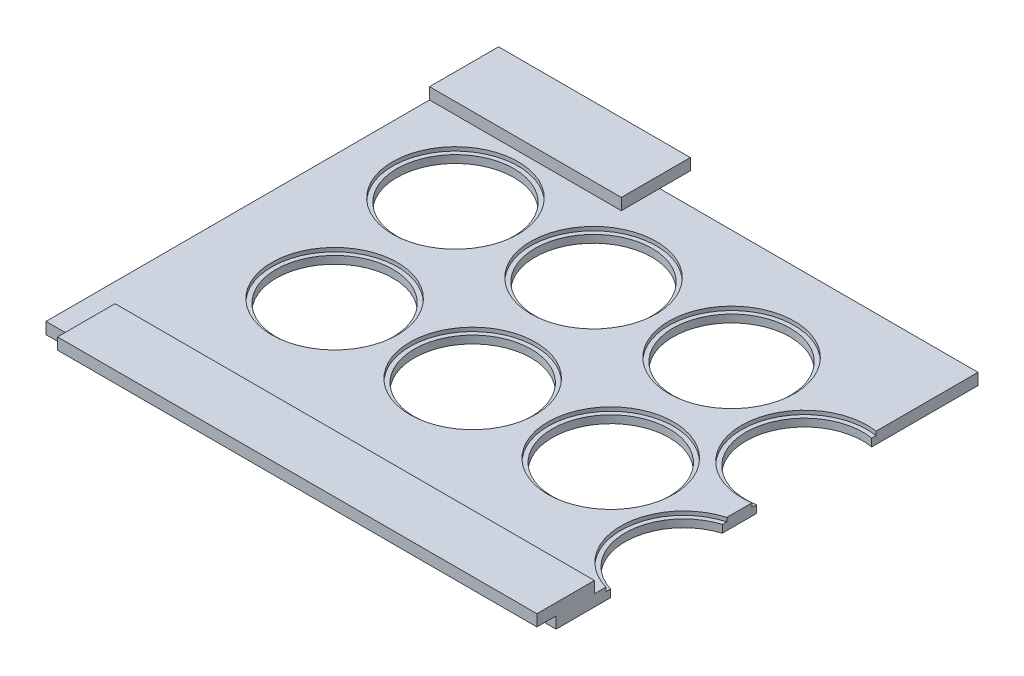
ISO-10303-21;
HEADER;
FILE_DESCRIPTION(('STEP AP214'),'2;1');
FILE_NAME('part.step','',(''),(''),'','','');
FILE_SCHEMA(('AUTOMOTIVE_DESIGN { 1 0 10303 214 1 1 1 1 }'));
ENDSEC;
DATA;
#1=APPLICATION_CONTEXT('core data for automotive mechanical design processes');
#2=APPLICATION_PROTOCOL_DEFINITION('international standard','automotive_design',2000,#1);
#3=PRODUCT_CONTEXT('',#1,'mechanical');
#4=PRODUCT('Part','Part','',(#3));
#5=PRODUCT_RELATED_PRODUCT_CATEGORY('part','',(#4));
#6=PRODUCT_DEFINITION_FORMATION('','',#4);
#7=PRODUCT_DEFINITION_CONTEXT('part definition',#1,'design');
#8=PRODUCT_DEFINITION('design','',#6,#7);
#9=PRODUCT_DEFINITION_SHAPE('','',#8);
#10=(LENGTH_UNIT() NAMED_UNIT(*) SI_UNIT(.MILLI.,.METRE.));
#11=(NAMED_UNIT(*) PLANE_ANGLE_UNIT() SI_UNIT($,.RADIAN.));
#12=(NAMED_UNIT(*) SI_UNIT($,.STERADIAN.) SOLID_ANGLE_UNIT());
#13=UNCERTAINTY_MEASURE_WITH_UNIT(LENGTH_MEASURE(1.E-05),#10,'distance_accuracy_value','');
#14=(GEOMETRIC_REPRESENTATION_CONTEXT(3) GLOBAL_UNCERTAINTY_ASSIGNED_CONTEXT((#13)) GLOBAL_UNIT_ASSIGNED_CONTEXT((#10,
#11,#12)) REPRESENTATION_CONTEXT('',''));
#15=CARTESIAN_POINT('',(0.,0.,0.));
#16=DIRECTION('',(0.,0.,1.));
#17=DIRECTION('',(1.,0.,0.));
#18=AXIS2_PLACEMENT_3D('',#15,#16,#17);
#19=CARTESIAN_POINT('',(25.5,46.1335136523794,-81.25));
#20=DIRECTION('',(0.,-1.,0.));
#21=DIRECTION('',(0.,0.,-1.));
#22=AXIS2_PLACEMENT_3D('',#19,#20,#21);
#23=CYLINDRICAL_SURFACE('',#22,15.25);
#24=CARTESIAN_POINT('',(25.5,0.,-81.25));
#25=DIRECTION('',(0.,-1.,0.));
#26=DIRECTION('',(0.,0.,-1.));
#27=AXIS2_PLACEMENT_3D('',#24,#25,#26);
#28=CIRCLE('',#27,15.25);
#29=CARTESIAN_POINT('',(25.5,0.,-96.5));
#30=VERTEX_POINT('',#29);
#31=EDGE_CURVE('E288',#30,#30,#28,.T.);
#32=ORIENTED_EDGE('',*,*,#31,.T.);
#33=EDGE_LOOP('',(#32));
#34=FACE_BOUND('',#33,.T.);
#35=CARTESIAN_POINT('',(25.5,2.,-81.25));
#36=DIRECTION('',(0.,1.,0.));
#37=DIRECTION('',(0.,0.,1.));
#38=AXIS2_PLACEMENT_3D('',#35,#36,#37);
#39=CIRCLE('',#38,15.25);
#40=CARTESIAN_POINT('',(25.5,2.,-66.));
#41=VERTEX_POINT('',#40);
#42=EDGE_CURVE('E262',#41,#41,#39,.F.);
#43=ORIENTED_EDGE('',*,*,#42,.F.);
#44=EDGE_LOOP('',(#43));
#45=FACE_BOUND('',#44,.T.);
#46=ADVANCED_FACE('F34',(#34,#45),#23,.F.);
#47=CARTESIAN_POINT('',(137.5,46.1335136523794,-28.75));
#48=DIRECTION('',(0.,-1.,0.));
#49=DIRECTION('',(0.,0.,-1.));
#50=AXIS2_PLACEMENT_3D('',#47,#48,#49);
#51=CYLINDRICAL_SURFACE('',#50,15.25);
#52=CARTESIAN_POINT('',(137.5,2.,-28.75));
#53=DIRECTION('',(0.,1.,0.));
#54=DIRECTION('',(0.,0.,1.));
#55=AXIS2_PLACEMENT_3D('',#52,#53,#54);
#56=CIRCLE('',#55,15.25);
#57=CARTESIAN_POINT('',(133.,2.,-14.1790528791022));
#58=VERTEX_POINT('',#57);
#59=CARTESIAN_POINT('',(133.,2.,-43.3209471208978));
#60=VERTEX_POINT('',#59);
#61=EDGE_CURVE('E42',#58,#60,#56,.F.);
#62=ORIENTED_EDGE('',*,*,#61,.F.);
#63=DIRECTION('',(0.,-1.,0.));
#64=VECTOR('',#63,1.);
#65=CARTESIAN_POINT('',(133.,46.1335136523794,-14.1790528791022));
#66=LINE('',#65,#64);
#67=CARTESIAN_POINT('',(133.,0.,-14.1790528791022));
#68=VERTEX_POINT('',#67);
#69=EDGE_CURVE('E296',#68,#58,#66,.F.);
#70=ORIENTED_EDGE('',*,*,#69,.F.);
#71=CARTESIAN_POINT('',(137.5,0.,-28.75));
#72=DIRECTION('',(0.,-1.,0.));
#73=DIRECTION('',(0.,0.,-1.));
#74=AXIS2_PLACEMENT_3D('',#71,#72,#73);
#75=CIRCLE('',#74,15.25);
#76=CARTESIAN_POINT('',(133.,0.,-43.3209471208978));
#77=VERTEX_POINT('',#76);
#78=EDGE_CURVE('E275',#68,#77,#75,.T.);
#79=ORIENTED_EDGE('',*,*,#78,.T.);
#80=DIRECTION('',(0.,-1.,0.));
#81=VECTOR('',#80,1.);
#82=CARTESIAN_POINT('',(133.,46.1335136523794,-43.3209471208978));
#83=LINE('',#82,#81);
#84=EDGE_CURVE('E299',#60,#77,#83,.T.);
#85=ORIENTED_EDGE('',*,*,#84,.F.);
#86=EDGE_LOOP('',(#62,#70,#79,#85));
#87=FACE_BOUND('',#86,.T.);
#88=ADVANCED_FACE('F472',(#87),#51,.F.);
#89=CARTESIAN_POINT('',(104.5,46.1335136523794,-42.75));
#90=DIRECTION('',(0.,-1.,0.));
#91=DIRECTION('',(0.,0.,-1.));
#92=AXIS2_PLACEMENT_3D('',#89,#90,#91);
#93=CYLINDRICAL_SURFACE('',#92,15.25);
#94=CARTESIAN_POINT('',(104.5,0.,-42.75));
#95=DIRECTION('',(0.,-1.,0.));
#96=DIRECTION('',(0.,0.,-1.));
#97=AXIS2_PLACEMENT_3D('',#94,#95,#96);
#98=CIRCLE('',#97,15.25);
#99=CARTESIAN_POINT('',(104.5,0.,-58.));
#100=VERTEX_POINT('',#99);
#101=EDGE_CURVE('E280',#100,#100,#98,.T.);
#102=ORIENTED_EDGE('',*,*,#101,.T.);
#103=EDGE_LOOP('',(#102));
#104=FACE_BOUND('',#103,.T.);
#105=CARTESIAN_POINT('',(104.5,2.,-42.75));
#106=DIRECTION('',(0.,1.,0.));
#107=DIRECTION('',(0.,0.,1.));
#108=AXIS2_PLACEMENT_3D('',#105,#106,#107);
#109=CIRCLE('',#108,15.25);
#110=CARTESIAN_POINT('',(104.5,2.,-27.5));
#111=VERTEX_POINT('',#110);
#112=EDGE_CURVE('E258',#111,#111,#109,.F.);
#113=ORIENTED_EDGE('',*,*,#112,.F.);
#114=EDGE_LOOP('',(#113));
#115=FACE_BOUND('',#114,.T.);
#116=ADVANCED_FACE('F499',(#104,#115),#93,.F.);
#117=CARTESIAN_POINT('',(68.5,46.1335136523794,-42.75));
#118=DIRECTION('',(0.,-1.,0.));
#119=DIRECTION('',(0.,0.,-1.));
#120=AXIS2_PLACEMENT_3D('',#117,#118,#119);
#121=CYLINDRICAL_SURFACE('',#120,15.25);
#122=CARTESIAN_POINT('',(68.5,0.,-42.75));
#123=DIRECTION('',(0.,-1.,0.));
#124=DIRECTION('',(0.,0.,-1.));
#125=AXIS2_PLACEMENT_3D('',#122,#123,#124);
#126=CIRCLE('',#125,15.25);
#127=CARTESIAN_POINT('',(68.5,0.,-58.));
#128=VERTEX_POINT('',#127);
#129=EDGE_CURVE('E276',#128,#128,#126,.T.);
#130=ORIENTED_EDGE('',*,*,#129,.T.);
#131=EDGE_LOOP('',(#130));
#132=FACE_BOUND('',#131,.T.);
#133=CARTESIAN_POINT('',(68.5,2.,-42.75));
#134=DIRECTION('',(0.,1.,0.));
#135=DIRECTION('',(0.,0.,1.));
#136=AXIS2_PLACEMENT_3D('',#133,#134,#135);
#137=CIRCLE('',#136,15.25);
#138=CARTESIAN_POINT('',(68.5,2.,-27.5));
#139=VERTEX_POINT('',#138);
#140=EDGE_CURVE('E255',#139,#139,#137,.F.);
#141=ORIENTED_EDGE('',*,*,#140,.F.);
#142=EDGE_LOOP('',(#141));
#143=FACE_BOUND('',#142,.T.);
#144=ADVANCED_FACE('F567',(#132,#143),#121,.F.);
#145=CARTESIAN_POINT('',(130.5,46.1335136523794,-67.25));
#146=DIRECTION('',(0.,-1.,0.));
#147=DIRECTION('',(0.,0.,-1.));
#148=AXIS2_PLACEMENT_3D('',#145,#146,#147);
#149=CYLINDRICAL_SURFACE('',#148,15.25);
#150=CARTESIAN_POINT('',(130.5,2.,-67.25));
#151=DIRECTION('',(0.,1.,0.));
#152=DIRECTION('',(0.,0.,1.));
#153=AXIS2_PLACEMENT_3D('',#150,#151,#152);
#154=CIRCLE('',#153,15.25);
#155=CARTESIAN_POINT('',(133.,2.,-52.2063136166696));
#156=VERTEX_POINT('',#155);
#157=CARTESIAN_POINT('',(133.,2.,-82.2936863833304));
#158=VERTEX_POINT('',#157);
#159=EDGE_CURVE('E243',#156,#158,#154,.F.);
#160=ORIENTED_EDGE('',*,*,#159,.F.);
#161=DIRECTION('',(0.,-1.,0.));
#162=VECTOR('',#161,1.);
#163=CARTESIAN_POINT('',(133.,46.1335136523794,-52.2063136166696));
#164=LINE('',#163,#162);
#165=CARTESIAN_POINT('',(133.,0.,-52.2063136166696));
#166=VERTEX_POINT('',#165);
#167=EDGE_CURVE('E301',#166,#156,#164,.F.);
#168=ORIENTED_EDGE('',*,*,#167,.F.);
#169=CARTESIAN_POINT('',(130.5,0.,-67.25));
#170=DIRECTION('',(0.,-1.,0.));
#171=DIRECTION('',(0.,0.,-1.));
#172=AXIS2_PLACEMENT_3D('',#169,#170,#171);
#173=CIRCLE('',#172,15.25);
#174=CARTESIAN_POINT('',(133.,0.,-82.2936863833304));
#175=VERTEX_POINT('',#174);
#176=EDGE_CURVE('E240',#166,#175,#173,.T.);
#177=ORIENTED_EDGE('',*,*,#176,.T.);
#178=DIRECTION('',(0.,-1.,0.));
#179=VECTOR('',#178,1.);
#180=CARTESIAN_POINT('',(133.,46.1335136523794,-82.2936863833304));
#181=LINE('',#180,#179);
#182=EDGE_CURVE('E303',#158,#175,#181,.T.);
#183=ORIENTED_EDGE('',*,*,#182,.F.);
#184=EDGE_LOOP('',(#160,#168,#177,#183));
#185=FACE_BOUND('',#184,.T.);
#186=ADVANCED_FACE('F504',(#185),#149,.F.);
#187=CARTESIAN_POINT('',(97.5,46.1335136523794,-81.25));
#188=DIRECTION('',(0.,-1.,0.));
#189=DIRECTION('',(0.,0.,-1.));
#190=AXIS2_PLACEMENT_3D('',#187,#188,#189);
#191=CYLINDRICAL_SURFACE('',#190,15.25);
#192=CARTESIAN_POINT('',(97.5,0.,-81.25));
#193=DIRECTION('',(0.,-1.,0.));
#194=DIRECTION('',(0.,0.,-1.));
#195=AXIS2_PLACEMENT_3D('',#192,#193,#194);
#196=CIRCLE('',#195,15.25);
#197=CARTESIAN_POINT('',(97.5,0.,-96.5));
#198=VERTEX_POINT('',#197);
#199=EDGE_CURVE('E279',#198,#198,#196,.T.);
#200=ORIENTED_EDGE('',*,*,#199,.T.);
#201=EDGE_LOOP('',(#200));
#202=FACE_BOUND('',#201,.T.);
#203=CARTESIAN_POINT('',(97.5,2.,-81.25));
#204=DIRECTION('',(0.,1.,0.));
#205=DIRECTION('',(0.,0.,1.));
#206=AXIS2_PLACEMENT_3D('',#203,#204,#205);
#207=CIRCLE('',#206,15.25);
#208=CARTESIAN_POINT('',(97.5,2.,-66.));
#209=VERTEX_POINT('',#208);
#210=EDGE_CURVE('E251',#209,#209,#207,.F.);
#211=ORIENTED_EDGE('',*,*,#210,.F.);
#212=EDGE_LOOP('',(#211));
#213=FACE_BOUND('',#212,.T.);
#214=ADVANCED_FACE('F551',(#202,#213),#191,.F.);
#215=CARTESIAN_POINT('',(61.5,46.1335136523794,-81.25));
#216=DIRECTION('',(0.,-1.,0.));
#217=DIRECTION('',(0.,0.,-1.));
#218=AXIS2_PLACEMENT_3D('',#215,#216,#217);
#219=CYLINDRICAL_SURFACE('',#218,15.25);
#220=CARTESIAN_POINT('',(61.5,0.,-81.25));
#221=DIRECTION('',(0.,-1.,0.));
#222=DIRECTION('',(0.,0.,-1.));
#223=AXIS2_PLACEMENT_3D('',#220,#221,#222);
#224=CIRCLE('',#223,15.25);
#225=CARTESIAN_POINT('',(61.5,0.,-96.5));
#226=VERTEX_POINT('',#225);
#227=EDGE_CURVE('E289',#226,#226,#224,.T.);
#228=ORIENTED_EDGE('',*,*,#227,.T.);
#229=EDGE_LOOP('',(#228));
#230=FACE_BOUND('',#229,.T.);
#231=CARTESIAN_POINT('',(61.5,2.,-81.25));
#232=DIRECTION('',(0.,1.,0.));
#233=DIRECTION('',(0.,0.,1.));
#234=AXIS2_PLACEMENT_3D('',#231,#232,#233);
#235=CIRCLE('',#234,15.25);
#236=CARTESIAN_POINT('',(61.5,2.,-66.));
#237=VERTEX_POINT('',#236);
#238=EDGE_CURVE('E247',#237,#237,#235,.F.);
#239=ORIENTED_EDGE('',*,*,#238,.F.);
#240=EDGE_LOOP('',(#239));
#241=FACE_BOUND('',#240,.T.);
#242=ADVANCED_FACE('F541',(#230,#241),#219,.F.);
#243=CARTESIAN_POINT('',(32.5,46.1335136523794,-42.75));
#244=DIRECTION('',(0.,-1.,0.));
#245=DIRECTION('',(0.,0.,-1.));
#246=AXIS2_PLACEMENT_3D('',#243,#244,#245);
#247=CYLINDRICAL_SURFACE('',#246,15.25);
#248=CARTESIAN_POINT('',(32.5,0.,-42.75));
#249=DIRECTION('',(0.,-1.,0.));
#250=DIRECTION('',(0.,0.,-1.));
#251=AXIS2_PLACEMENT_3D('',#248,#249,#250);
#252=CIRCLE('',#251,15.25);
#253=CARTESIAN_POINT('',(32.5,0.,-58.));
#254=VERTEX_POINT('',#253);
#255=EDGE_CURVE('E285',#254,#254,#252,.T.);
#256=ORIENTED_EDGE('',*,*,#255,.T.);
#257=EDGE_LOOP('',(#256));
#258=FACE_BOUND('',#257,.T.);
#259=CARTESIAN_POINT('',(32.5,2.,-42.75));
#260=DIRECTION('',(0.,1.,0.));
#261=DIRECTION('',(0.,0.,1.));
#262=AXIS2_PLACEMENT_3D('',#259,#260,#261);
#263=CIRCLE('',#262,15.25);
#264=CARTESIAN_POINT('',(32.5,2.,-27.5));
#265=VERTEX_POINT('',#264);
#266=EDGE_CURVE('E244',#265,#265,#263,.F.);
#267=ORIENTED_EDGE('',*,*,#266,.F.);
#268=EDGE_LOOP('',(#267));
#269=FACE_BOUND('',#268,.T.);
#270=ADVANCED_FACE('F536',(#258,#269),#247,.F.);
#271=CARTESIAN_POINT('',(133.,3.,0.));
#272=DIRECTION('',(-1.,0.,0.));
#273=DIRECTION('',(0.,0.,1.));
#274=AXIS2_PLACEMENT_3D('',#271,#272,#273);
#275=PLANE('',#274);
#276=DIRECTION('',(0.,0.,-1.));
#277=VECTOR('',#276,1.);
#278=CARTESIAN_POINT('',(133.,3.,0.));
#279=LINE('',#278,#277);
#280=CARTESIAN_POINT('',(133.,3.,-83.4330350985222));
#281=VERTEX_POINT('',#280);
#282=CARTESIAN_POINT('',(133.,3.,-110.));
#283=VERTEX_POINT('',#282);
#284=EDGE_CURVE('E204',#281,#283,#279,.T.);
#285=ORIENTED_EDGE('',*,*,#284,.F.);
#286=DIRECTION('',(0.,1.,0.));
#287=VECTOR('',#286,1.);
#288=CARTESIAN_POINT('',(133.,2.,-83.4330350985222));
#289=LINE('',#288,#287);
#290=CARTESIAN_POINT('',(133.,2.,-83.4330350985222));
#291=VERTEX_POINT('',#290);
#292=EDGE_CURVE('E184',#281,#291,#289,.F.);
#293=ORIENTED_EDGE('',*,*,#292,.T.);
#294=DIRECTION('',(0.,0.,-1.));
#295=VECTOR('',#294,1.);
#296=CARTESIAN_POINT('',(133.,2.,0.));
#297=LINE('',#296,#295);
#298=EDGE_CURVE('E259',#158,#291,#297,.T.);
#299=ORIENTED_EDGE('',*,*,#298,.F.);
#300=ORIENTED_EDGE('',*,*,#182,.T.);
#301=DIRECTION('',(0.,0.,-1.));
#302=VECTOR('',#301,1.);
#303=CARTESIAN_POINT('',(133.,0.,0.));
#304=LINE('',#303,#302);
#305=CARTESIAN_POINT('',(133.,0.,-110.));
#306=VERTEX_POINT('',#305);
#307=EDGE_CURVE('E221',#175,#306,#304,.T.);
#308=ORIENTED_EDGE('',*,*,#307,.T.);
#309=DIRECTION('',(0.,-1.,0.));
#310=VECTOR('',#309,1.);
#311=CARTESIAN_POINT('',(133.,3.,-110.));
#312=LINE('',#311,#310);
#313=EDGE_CURVE('E231',#283,#306,#312,.T.);
#314=ORIENTED_EDGE('',*,*,#313,.F.);
#315=EDGE_LOOP('',(#285,#293,#299,#300,#308,#314));
#316=FACE_BOUND('',#315,.T.);
#317=ADVANCED_FACE('F440',(#316),#275,.F.);
#318=CARTESIAN_POINT('',(133.,3.,-44.4945427053313));
#319=VERTEX_POINT('',#318);
#320=CARTESIAN_POINT('',(133.,3.,-51.0669649014778));
#321=VERTEX_POINT('',#320);
#322=EDGE_CURVE('E195',#319,#321,#279,.T.);
#323=ORIENTED_EDGE('',*,*,#322,.F.);
#324=DIRECTION('',(0.,1.,0.));
#325=VECTOR('',#324,1.);
#326=CARTESIAN_POINT('',(133.,2.,-44.4945427053313));
#327=LINE('',#326,#325);
#328=CARTESIAN_POINT('',(133.,2.,-44.4945427053313));
#329=VERTEX_POINT('',#328);
#330=EDGE_CURVE('E197',#319,#329,#327,.F.);
#331=ORIENTED_EDGE('',*,*,#330,.T.);
#332=DIRECTION('',(0.,0.,-1.));
#333=VECTOR('',#332,1.);
#334=CARTESIAN_POINT('',(133.,2.,0.));
#335=LINE('',#334,#333);
#336=EDGE_CURVE('E264',#60,#329,#335,.T.);
#337=ORIENTED_EDGE('',*,*,#336,.F.);
#338=ORIENTED_EDGE('',*,*,#84,.T.);
#339=EDGE_CURVE('E226',#77,#166,#304,.T.);
#340=ORIENTED_EDGE('',*,*,#339,.T.);
#341=ORIENTED_EDGE('',*,*,#167,.T.);
#342=DIRECTION('',(0.,0.,-1.));
#343=VECTOR('',#342,1.);
#344=CARTESIAN_POINT('',(133.,2.,0.));
#345=LINE('',#344,#343);
#346=CARTESIAN_POINT('',(133.,2.,-51.0669649014778));
#347=VERTEX_POINT('',#346);
#348=EDGE_CURVE('E57',#347,#156,#345,.T.);
#349=ORIENTED_EDGE('',*,*,#348,.F.);
#350=DIRECTION('',(0.,1.,0.));
#351=VECTOR('',#350,1.);
#352=CARTESIAN_POINT('',(133.,2.,-51.0669649014778));
#353=LINE('',#352,#351);
#354=EDGE_CURVE('E182',#347,#321,#353,.T.);
#355=ORIENTED_EDGE('',*,*,#354,.T.);
#356=EDGE_LOOP('',(#323,#331,#337,#338,#340,#341,#349,#355));
#357=FACE_BOUND('',#356,.T.);
#358=ADVANCED_FACE('F193',(#357),#275,.F.);
#359=CARTESIAN_POINT('',(0.,3.,0.));
#360=DIRECTION('',(0.,-1.,0.));
#361=DIRECTION('',(0.,0.,-1.));
#362=AXIS2_PLACEMENT_3D('',#359,#360,#361);
#363=PLANE('',#362);
#364=CARTESIAN_POINT('',(61.5,3.,-81.25));
#365=DIRECTION('',(0.,1.,0.));
#366=DIRECTION('',(0.,0.,1.));
#367=AXIS2_PLACEMENT_3D('',#364,#365,#366);
#368=CIRCLE('',#367,16.375);
#369=CARTESIAN_POINT('',(61.5,3.,-64.875));
#370=VERTEX_POINT('',#369);
#371=EDGE_CURVE('E412',#370,#370,#368,.T.);
#372=ORIENTED_EDGE('',*,*,#371,.F.);
#373=EDGE_LOOP('',(#372));
#374=FACE_BOUND('',#373,.T.);
#375=CARTESIAN_POINT('',(97.5,3.,-81.25));
#376=DIRECTION('',(0.,1.,0.));
#377=DIRECTION('',(0.,0.,1.));
#378=AXIS2_PLACEMENT_3D('',#375,#376,#377);
#379=CIRCLE('',#378,16.375);
#380=CARTESIAN_POINT('',(97.5,3.,-64.875));
#381=VERTEX_POINT('',#380);
#382=EDGE_CURVE('E418',#381,#381,#379,.T.);
#383=ORIENTED_EDGE('',*,*,#382,.F.);
#384=EDGE_LOOP('',(#383));
#385=FACE_BOUND('',#384,.T.);
#386=CARTESIAN_POINT('',(32.5,3.,-42.75));
#387=DIRECTION('',(0.,1.,0.));
#388=DIRECTION('',(0.,0.,1.));
#389=AXIS2_PLACEMENT_3D('',#386,#387,#388);
#390=CIRCLE('',#389,16.375);
#391=CARTESIAN_POINT('',(32.5,3.,-26.375));
#392=VERTEX_POINT('',#391);
#393=EDGE_CURVE('E424',#392,#392,#390,.T.);
#394=ORIENTED_EDGE('',*,*,#393,.F.);
#395=EDGE_LOOP('',(#394));
#396=FACE_BOUND('',#395,.T.);
#397=CARTESIAN_POINT('',(68.5,3.,-42.75));
#398=DIRECTION('',(0.,1.,0.));
#399=DIRECTION('',(0.,0.,1.));
#400=AXIS2_PLACEMENT_3D('',#397,#398,#399);
#401=CIRCLE('',#400,16.375);
#402=CARTESIAN_POINT('',(68.5,3.,-26.375));
#403=VERTEX_POINT('',#402);
#404=EDGE_CURVE('E405',#403,#403,#401,.T.);
#405=ORIENTED_EDGE('',*,*,#404,.F.);
#406=EDGE_LOOP('',(#405));
#407=FACE_BOUND('',#406,.T.);
#408=CARTESIAN_POINT('',(104.5,3.,-42.75));
#409=DIRECTION('',(0.,1.,0.));
#410=DIRECTION('',(0.,0.,1.));
#411=AXIS2_PLACEMENT_3D('',#408,#409,#410);
#412=CIRCLE('',#411,16.375);
#413=CARTESIAN_POINT('',(104.5,3.,-26.375));
#414=VERTEX_POINT('',#413);
#415=EDGE_CURVE('E400',#414,#414,#412,.T.);
#416=ORIENTED_EDGE('',*,*,#415,.F.);
#417=EDGE_LOOP('',(#416));
#418=FACE_BOUND('',#417,.T.);
#419=CARTESIAN_POINT('',(25.5,3.,-81.25));
#420=DIRECTION('',(0.,1.,0.));
#421=DIRECTION('',(0.,0.,1.));
#422=AXIS2_PLACEMENT_3D('',#419,#420,#421);
#423=CIRCLE('',#422,16.375);
#424=CARTESIAN_POINT('',(25.5,3.,-64.875));
#425=VERTEX_POINT('',#424);
#426=EDGE_CURVE('E411',#425,#425,#423,.T.);
#427=ORIENTED_EDGE('',*,*,#426,.F.);
#428=EDGE_LOOP('',(#427));
#429=FACE_BOUND('',#428,.T.);
#430=CARTESIAN_POINT('',(133.,3.,-9.99999999999999));
#431=VERTEX_POINT('',#430);
#432=CARTESIAN_POINT('',(133.,3.,-13.0054572946687));
#433=VERTEX_POINT('',#432);
#434=EDGE_CURVE('E203',#431,#433,#279,.T.);
#435=ORIENTED_EDGE('',*,*,#434,.T.);
#436=CARTESIAN_POINT('',(137.5,3.,-28.75));
#437=DIRECTION('',(0.,1.,0.));
#438=DIRECTION('',(0.,0.,1.));
#439=AXIS2_PLACEMENT_3D('',#436,#437,#438);
#440=CIRCLE('',#439,16.375);
#441=EDGE_CURVE('E202',#319,#433,#440,.T.);
#442=ORIENTED_EDGE('',*,*,#441,.F.);
#443=ORIENTED_EDGE('',*,*,#322,.T.);
#444=CARTESIAN_POINT('',(130.5,3.,-67.25));
#445=DIRECTION('',(0.,1.,0.));
#446=DIRECTION('',(0.,0.,1.));
#447=AXIS2_PLACEMENT_3D('',#444,#445,#446);
#448=CIRCLE('',#447,16.375);
#449=EDGE_CURVE('E178',#281,#321,#448,.T.);
#450=ORIENTED_EDGE('',*,*,#449,.F.);
#451=ORIENTED_EDGE('',*,*,#284,.T.);
#452=DIRECTION('',(-1.,0.,0.));
#453=VECTOR('',#452,1.);
#454=CARTESIAN_POINT('',(0.,3.,-110.));
#455=LINE('',#454,#453);
#456=CARTESIAN_POINT('',(50.,3.,-110.));
#457=VERTEX_POINT('',#456);
#458=EDGE_CURVE('E211',#283,#457,#455,.T.);
#459=ORIENTED_EDGE('',*,*,#458,.T.);
#460=DIRECTION('',(0.,0.,-1.));
#461=VECTOR('',#460,1.);
#462=CARTESIAN_POINT('',(50.,3.,-118.));
#463=LINE('',#462,#461);
#464=CARTESIAN_POINT('',(50.,3.,-100.));
#465=VERTEX_POINT('',#464);
#466=EDGE_CURVE('E359',#465,#457,#463,.T.);
#467=ORIENTED_EDGE('',*,*,#466,.F.);
#468=DIRECTION('',(1.,0.,0.));
#469=VECTOR('',#468,1.);
#470=CARTESIAN_POINT('',(0.,3.,-100.));
#471=LINE('',#470,#469);
#472=CARTESIAN_POINT('',(0.,3.,-100.));
#473=VERTEX_POINT('',#472);
#474=EDGE_CURVE('E355',#473,#465,#471,.T.);
#475=ORIENTED_EDGE('',*,*,#474,.F.);
#476=DIRECTION('',(0.,0.,1.));
#477=VECTOR('',#476,1.);
#478=CARTESIAN_POINT('',(0.,3.,0.));
#479=LINE('',#478,#477);
#480=CARTESIAN_POINT('',(0.,3.,0.));
#481=VERTEX_POINT('',#480);
#482=EDGE_CURVE('E228',#473,#481,#479,.T.);
#483=ORIENTED_EDGE('',*,*,#482,.T.);
#484=DIRECTION('',(1.,0.,0.));
#485=VECTOR('',#484,1.);
#486=CARTESIAN_POINT('',(0.,3.,0.));
#487=LINE('',#486,#485);
#488=CARTESIAN_POINT('',(8.00000000000001,3.,0.));
#489=VERTEX_POINT('',#488);
#490=EDGE_CURVE('E207',#481,#489,#487,.T.);
#491=ORIENTED_EDGE('',*,*,#490,.T.);
#492=DIRECTION('',(0.,0.,1.));
#493=VECTOR('',#492,1.);
#494=CARTESIAN_POINT('',(8.00000000000001,3.,5.00000000000002));
#495=LINE('',#494,#493);
#496=CARTESIAN_POINT('',(8.00000000000001,3.,-9.99999999999998));
#497=VERTEX_POINT('',#496);
#498=EDGE_CURVE('E323',#497,#489,#495,.T.);
#499=ORIENTED_EDGE('',*,*,#498,.F.);
#500=DIRECTION('',(-1.,0.,0.));
#501=VECTOR('',#500,1.);
#502=CARTESIAN_POINT('',(133.,3.,-9.99999999999999));
#503=LINE('',#502,#501);
#504=EDGE_CURVE('E319',#431,#497,#503,.T.);
#505=ORIENTED_EDGE('',*,*,#504,.F.);
#506=EDGE_LOOP('',(#435,#442,#443,#450,#451,#459,#467,#475,#483,#491,#499,#505));
#507=FACE_BOUND('',#506,.T.);
#508=ADVANCED_FACE('F201',(#374,#385,#396,#407,#418,#429,#507),#363,.F.);
#509=CARTESIAN_POINT('',(0.,3.,0.));
#510=DIRECTION('',(1.,0.,0.));
#511=DIRECTION('',(0.,0.,-1.));
#512=AXIS2_PLACEMENT_3D('',#509,#510,#511);
#513=PLANE('',#512);
#514=DIRECTION('',(0.,0.,1.));
#515=VECTOR('',#514,1.);
#516=CARTESIAN_POINT('',(0.,0.,0.));
#517=LINE('',#516,#515);
#518=CARTESIAN_POINT('',(0.,0.,-110.));
#519=VERTEX_POINT('',#518);
#520=CARTESIAN_POINT('',(0.,0.,0.));
#521=VERTEX_POINT('',#520);
#522=EDGE_CURVE('E215',#519,#521,#517,.T.);
#523=ORIENTED_EDGE('',*,*,#522,.T.);
#524=DIRECTION('',(0.,-1.,0.));
#525=VECTOR('',#524,1.);
#526=CARTESIAN_POINT('',(0.,3.,0.));
#527=LINE('',#526,#525);
#528=EDGE_CURVE('E237',#481,#521,#527,.T.);
#529=ORIENTED_EDGE('',*,*,#528,.F.);
#530=ORIENTED_EDGE('',*,*,#482,.F.);
#531=DIRECTION('',(0.,-1.,0.));
#532=VECTOR('',#531,1.);
#533=CARTESIAN_POINT('',(0.,6.,-100.));
#534=LINE('',#533,#532);
#535=CARTESIAN_POINT('',(0.,6.,-100.));
#536=VERTEX_POINT('',#535);
#537=EDGE_CURVE('E219',#536,#473,#534,.T.);
#538=ORIENTED_EDGE('',*,*,#537,.F.);
#539=DIRECTION('',(0.,0.,1.));
#540=VECTOR('',#539,1.);
#541=CARTESIAN_POINT('',(0.,6.,-118.));
#542=LINE('',#541,#540);
#543=CARTESIAN_POINT('',(0.,6.,-118.));
#544=VERTEX_POINT('',#543);
#545=EDGE_CURVE('E342',#544,#536,#542,.T.);
#546=ORIENTED_EDGE('',*,*,#545,.F.);
#547=DIRECTION('',(0.,-1.,0.));
#548=VECTOR('',#547,1.);
#549=CARTESIAN_POINT('',(0.,6.,-118.));
#550=LINE('',#549,#548);
#551=CARTESIAN_POINT('',(0.,3.,-118.));
#552=VERTEX_POINT('',#551);
#553=EDGE_CURVE('E352',#544,#552,#550,.T.);
#554=ORIENTED_EDGE('',*,*,#553,.T.);
#555=DIRECTION('',(0.,0.,1.));
#556=VECTOR('',#555,1.);
#557=CARTESIAN_POINT('',(0.,3.,-118.));
#558=LINE('',#557,#556);
#559=CARTESIAN_POINT('',(0.,3.,-110.));
#560=VERTEX_POINT('',#559);
#561=EDGE_CURVE('E341',#552,#560,#558,.T.);
#562=ORIENTED_EDGE('',*,*,#561,.T.);
#563=DIRECTION('',(0.,-1.,0.));
#564=VECTOR('',#563,1.);
#565=CARTESIAN_POINT('',(0.,3.,-110.));
#566=LINE('',#565,#564);
#567=EDGE_CURVE('E214',#560,#519,#566,.T.);
#568=ORIENTED_EDGE('',*,*,#567,.T.);
#569=EDGE_LOOP('',(#523,#529,#530,#538,#546,#554,#562,#568));
#570=FACE_BOUND('',#569,.T.);
#571=ADVANCED_FACE('F36',(#570),#513,.F.);
#572=CARTESIAN_POINT('',(0.,3.,0.));
#573=DIRECTION('',(0.,0.,-1.));
#574=DIRECTION('',(-1.,0.,0.));
#575=AXIS2_PLACEMENT_3D('',#572,#573,#574);
#576=PLANE('',#575);
#577=DIRECTION('',(1.,0.,0.));
#578=VECTOR('',#577,1.);
#579=CARTESIAN_POINT('',(0.,0.,0.));
#580=LINE('',#579,#578);
#581=CARTESIAN_POINT('',(133.,0.,0.));
#582=VERTEX_POINT('',#581);
#583=EDGE_CURVE('E218',#521,#582,#580,.T.);
#584=ORIENTED_EDGE('',*,*,#583,.T.);
#585=DIRECTION('',(0.,-1.,0.));
#586=VECTOR('',#585,1.);
#587=CARTESIAN_POINT('',(133.,3.,0.));
#588=LINE('',#587,#586);
#589=CARTESIAN_POINT('',(133.,3.,0.));
#590=VERTEX_POINT('',#589);
#591=EDGE_CURVE('E234',#590,#582,#588,.T.);
#592=ORIENTED_EDGE('',*,*,#591,.F.);
#593=DIRECTION('',(1.,0.,0.));
#594=VECTOR('',#593,1.);
#595=CARTESIAN_POINT('',(0.,3.,0.));
#596=LINE('',#595,#594);
#597=EDGE_CURVE('E338',#489,#590,#596,.T.);
#598=ORIENTED_EDGE('',*,*,#597,.F.);
#599=ORIENTED_EDGE('',*,*,#490,.F.);
#600=ORIENTED_EDGE('',*,*,#528,.T.);
#601=EDGE_LOOP('',(#584,#592,#598,#599,#600));
#602=FACE_BOUND('',#601,.T.);
#603=ADVANCED_FACE('F461',(#602),#576,.F.);
#604=DIRECTION('',(0.,0.,-1.));
#605=VECTOR('',#604,1.);
#606=CARTESIAN_POINT('',(133.,2.,0.));
#607=LINE('',#606,#605);
#608=CARTESIAN_POINT('',(133.,2.,-13.0054572946687));
#609=VERTEX_POINT('',#608);
#610=EDGE_CURVE('E49',#609,#58,#607,.T.);
#611=ORIENTED_EDGE('',*,*,#610,.F.);
#612=DIRECTION('',(0.,1.,0.));
#613=VECTOR('',#612,1.);
#614=CARTESIAN_POINT('',(133.,2.,-13.0054572946687));
#615=LINE('',#614,#613);
#616=EDGE_CURVE('E11',#609,#433,#615,.T.);
#617=ORIENTED_EDGE('',*,*,#616,.T.);
#618=ORIENTED_EDGE('',*,*,#434,.F.);
#619=DIRECTION('',(0.,-1.,0.));
#620=VECTOR('',#619,1.);
#621=CARTESIAN_POINT('',(133.,6.,-9.99999999999999));
#622=LINE('',#621,#620);
#623=CARTESIAN_POINT('',(133.,6.,-9.99999999999999));
#624=VERTEX_POINT('',#623);
#625=EDGE_CURVE('E335',#624,#431,#622,.T.);
#626=ORIENTED_EDGE('',*,*,#625,.F.);
#627=DIRECTION('',(0.,0.,-1.));
#628=VECTOR('',#627,1.);
#629=CARTESIAN_POINT('',(133.,6.,5.00000000000001));
#630=LINE('',#629,#628);
#631=CARTESIAN_POINT('',(133.,6.,5.00000000000001));
#632=VERTEX_POINT('',#631);
#633=EDGE_CURVE('E306',#632,#624,#630,.T.);
#634=ORIENTED_EDGE('',*,*,#633,.F.);
#635=DIRECTION('',(0.,-1.,0.));
#636=VECTOR('',#635,1.);
#637=CARTESIAN_POINT('',(133.,6.,5.00000000000001));
#638=LINE('',#637,#636);
#639=CARTESIAN_POINT('',(133.,3.,5.00000000000001));
#640=VERTEX_POINT('',#639);
#641=EDGE_CURVE('E316',#632,#640,#638,.T.);
#642=ORIENTED_EDGE('',*,*,#641,.T.);
#643=DIRECTION('',(0.,0.,-1.));
#644=VECTOR('',#643,1.);
#645=CARTESIAN_POINT('',(133.,3.,5.00000000000001));
#646=LINE('',#645,#644);
#647=EDGE_CURVE('E305',#640,#590,#646,.T.);
#648=ORIENTED_EDGE('',*,*,#647,.T.);
#649=ORIENTED_EDGE('',*,*,#591,.T.);
#650=EDGE_CURVE('E222',#582,#68,#304,.T.);
#651=ORIENTED_EDGE('',*,*,#650,.T.);
#652=ORIENTED_EDGE('',*,*,#69,.T.);
#653=EDGE_LOOP('',(#611,#617,#618,#626,#634,#642,#648,#649,#651,#652));
#654=FACE_BOUND('',#653,.T.);
#655=ADVANCED_FACE('F392',(#654),#275,.F.);
#656=CARTESIAN_POINT('',(0.,3.,-110.));
#657=DIRECTION('',(0.,0.,1.));
#658=DIRECTION('',(1.,0.,0.));
#659=AXIS2_PLACEMENT_3D('',#656,#657,#658);
#660=PLANE('',#659);
#661=DIRECTION('',(-1.,0.,0.));
#662=VECTOR('',#661,1.);
#663=CARTESIAN_POINT('',(0.,0.,-110.));
#664=LINE('',#663,#662);
#665=EDGE_CURVE('E225',#306,#519,#664,.T.);
#666=ORIENTED_EDGE('',*,*,#665,.T.);
#667=ORIENTED_EDGE('',*,*,#567,.F.);
#668=EDGE_CURVE('E206',#457,#560,#455,.T.);
#669=ORIENTED_EDGE('',*,*,#668,.F.);
#670=ORIENTED_EDGE('',*,*,#458,.F.);
#671=ORIENTED_EDGE('',*,*,#313,.T.);
#672=EDGE_LOOP('',(#666,#667,#669,#670,#671));
#673=FACE_BOUND('',#672,.T.);
#674=ADVANCED_FACE('F475',(#673),#660,.F.);
#675=CARTESIAN_POINT('',(0.,0.,0.));
#676=DIRECTION('',(0.,-1.,0.));
#677=DIRECTION('',(0.,0.,-1.));
#678=AXIS2_PLACEMENT_3D('',#675,#676,#677);
#679=PLANE('',#678);
#680=ORIENTED_EDGE('',*,*,#255,.F.);
#681=EDGE_LOOP('',(#680));
#682=FACE_BOUND('',#681,.T.);
#683=ORIENTED_EDGE('',*,*,#227,.F.);
#684=EDGE_LOOP('',(#683));
#685=FACE_BOUND('',#684,.T.);
#686=ORIENTED_EDGE('',*,*,#199,.F.);
#687=EDGE_LOOP('',(#686));
#688=FACE_BOUND('',#687,.T.);
#689=ORIENTED_EDGE('',*,*,#176,.F.);
#690=ORIENTED_EDGE('',*,*,#339,.F.);
#691=ORIENTED_EDGE('',*,*,#78,.F.);
#692=ORIENTED_EDGE('',*,*,#650,.F.);
#693=ORIENTED_EDGE('',*,*,#583,.F.);
#694=ORIENTED_EDGE('',*,*,#522,.F.);
#695=ORIENTED_EDGE('',*,*,#665,.F.);
#696=ORIENTED_EDGE('',*,*,#307,.F.);
#697=EDGE_LOOP('',(#689,#690,#691,#692,#693,#694,#695,#696));
#698=FACE_BOUND('',#697,.T.);
#699=ORIENTED_EDGE('',*,*,#129,.F.);
#700=EDGE_LOOP('',(#699));
#701=FACE_BOUND('',#700,.T.);
#702=ORIENTED_EDGE('',*,*,#101,.F.);
#703=EDGE_LOOP('',(#702));
#704=FACE_BOUND('',#703,.T.);
#705=ORIENTED_EDGE('',*,*,#31,.F.);
#706=EDGE_LOOP('',(#705));
#707=FACE_BOUND('',#706,.T.);
#708=ADVANCED_FACE('F466',(#682,#685,#688,#698,#701,#704,#707),#679,.T.);
#709=CARTESIAN_POINT('',(0.,3.,0.));
#710=DIRECTION('',(0.,1.,0.));
#711=DIRECTION('',(0.,0.,1.));
#712=AXIS2_PLACEMENT_3D('',#709,#710,#711);
#713=PLANE('',#712);
#714=CARTESIAN_POINT('',(50.,3.,-118.));
#715=VERTEX_POINT('',#714);
#716=EDGE_CURVE('E358',#457,#715,#463,.T.);
#717=ORIENTED_EDGE('',*,*,#716,.F.);
#718=ORIENTED_EDGE('',*,*,#668,.T.);
#719=ORIENTED_EDGE('',*,*,#561,.F.);
#720=DIRECTION('',(-1.,0.,0.));
#721=VECTOR('',#720,1.);
#722=CARTESIAN_POINT('',(0.,3.,-118.));
#723=LINE('',#722,#721);
#724=EDGE_CURVE('E346',#715,#552,#723,.T.);
#725=ORIENTED_EDGE('',*,*,#724,.F.);
#726=EDGE_LOOP('',(#717,#718,#719,#725));
#727=FACE_BOUND('',#726,.T.);
#728=ADVANCED_FACE('F448',(#727),#713,.F.);
#729=CARTESIAN_POINT('',(0.,6.,-100.));
#730=DIRECTION('',(0.,0.,-1.));
#731=DIRECTION('',(-1.,0.,0.));
#732=AXIS2_PLACEMENT_3D('',#729,#730,#731);
#733=PLANE('',#732);
#734=ORIENTED_EDGE('',*,*,#474,.T.);
#735=DIRECTION('',(0.,-1.,0.));
#736=VECTOR('',#735,1.);
#737=CARTESIAN_POINT('',(50.,6.,-100.));
#738=LINE('',#737,#736);
#739=CARTESIAN_POINT('',(50.,6.,-100.));
#740=VERTEX_POINT('',#739);
#741=EDGE_CURVE('E368',#740,#465,#738,.T.);
#742=ORIENTED_EDGE('',*,*,#741,.F.);
#743=DIRECTION('',(1.,0.,0.));
#744=VECTOR('',#743,1.);
#745=CARTESIAN_POINT('',(0.,6.,-100.));
#746=LINE('',#745,#744);
#747=EDGE_CURVE('E345',#536,#740,#746,.T.);
#748=ORIENTED_EDGE('',*,*,#747,.F.);
#749=ORIENTED_EDGE('',*,*,#537,.T.);
#750=EDGE_LOOP('',(#734,#742,#748,#749));
#751=FACE_BOUND('',#750,.T.);
#752=ADVANCED_FACE('F456',(#751),#733,.F.);
#753=CARTESIAN_POINT('',(50.,6.,-118.));
#754=DIRECTION('',(-1.,0.,0.));
#755=DIRECTION('',(0.,0.,1.));
#756=AXIS2_PLACEMENT_3D('',#753,#754,#755);
#757=PLANE('',#756);
#758=ORIENTED_EDGE('',*,*,#466,.T.);
#759=ORIENTED_EDGE('',*,*,#716,.T.);
#760=DIRECTION('',(0.,-1.,0.));
#761=VECTOR('',#760,1.);
#762=CARTESIAN_POINT('',(50.,6.,-118.));
#763=LINE('',#762,#761);
#764=CARTESIAN_POINT('',(50.,6.,-118.));
#765=VERTEX_POINT('',#764);
#766=EDGE_CURVE('E365',#765,#715,#763,.T.);
#767=ORIENTED_EDGE('',*,*,#766,.F.);
#768=DIRECTION('',(0.,0.,-1.));
#769=VECTOR('',#768,1.);
#770=CARTESIAN_POINT('',(50.,6.,-118.));
#771=LINE('',#770,#769);
#772=EDGE_CURVE('E348',#740,#765,#771,.T.);
#773=ORIENTED_EDGE('',*,*,#772,.F.);
#774=ORIENTED_EDGE('',*,*,#741,.T.);
#775=EDGE_LOOP('',(#758,#759,#767,#773,#774));
#776=FACE_BOUND('',#775,.T.);
#777=ADVANCED_FACE('F452',(#776),#757,.F.);
#778=CARTESIAN_POINT('',(0.,6.,-118.));
#779=DIRECTION('',(0.,0.,1.));
#780=DIRECTION('',(1.,0.,0.));
#781=AXIS2_PLACEMENT_3D('',#778,#779,#780);
#782=PLANE('',#781);
#783=ORIENTED_EDGE('',*,*,#724,.T.);
#784=ORIENTED_EDGE('',*,*,#553,.F.);
#785=DIRECTION('',(-1.,0.,0.));
#786=VECTOR('',#785,1.);
#787=CARTESIAN_POINT('',(0.,6.,-118.));
#788=LINE('',#787,#786);
#789=EDGE_CURVE('E350',#765,#544,#788,.T.);
#790=ORIENTED_EDGE('',*,*,#789,.F.);
#791=ORIENTED_EDGE('',*,*,#766,.T.);
#792=EDGE_LOOP('',(#783,#784,#790,#791));
#793=FACE_BOUND('',#792,.T.);
#794=ADVANCED_FACE('F479',(#793),#782,.F.);
#795=CARTESIAN_POINT('',(0.,6.,0.));
#796=DIRECTION('',(0.,1.,0.));
#797=DIRECTION('',(0.,0.,1.));
#798=AXIS2_PLACEMENT_3D('',#795,#796,#797);
#799=PLANE('',#798);
#800=ORIENTED_EDGE('',*,*,#545,.T.);
#801=ORIENTED_EDGE('',*,*,#747,.T.);
#802=ORIENTED_EDGE('',*,*,#772,.T.);
#803=ORIENTED_EDGE('',*,*,#789,.T.);
#804=EDGE_LOOP('',(#800,#801,#802,#803));
#805=FACE_BOUND('',#804,.T.);
#806=ADVANCED_FACE('F481',(#805),#799,.T.);
#807=CARTESIAN_POINT('',(0.,3.,0.));
#808=DIRECTION('',(0.,1.,0.));
#809=DIRECTION('',(0.,0.,1.));
#810=AXIS2_PLACEMENT_3D('',#807,#808,#809);
#811=PLANE('',#810);
#812=CARTESIAN_POINT('',(8.00000000000001,3.,5.00000000000002));
#813=VERTEX_POINT('',#812);
#814=EDGE_CURVE('E322',#489,#813,#495,.T.);
#815=ORIENTED_EDGE('',*,*,#814,.F.);
#816=ORIENTED_EDGE('',*,*,#597,.T.);
#817=ORIENTED_EDGE('',*,*,#647,.F.);
#818=DIRECTION('',(1.,0.,0.));
#819=VECTOR('',#818,1.);
#820=CARTESIAN_POINT('',(133.,3.,5.00000000000001));
#821=LINE('',#820,#819);
#822=EDGE_CURVE('E310',#813,#640,#821,.T.);
#823=ORIENTED_EDGE('',*,*,#822,.F.);
#824=EDGE_LOOP('',(#815,#816,#817,#823));
#825=FACE_BOUND('',#824,.T.);
#826=ADVANCED_FACE('F381',(#825),#811,.F.);
#827=CARTESIAN_POINT('',(133.,6.,-9.99999999999999));
#828=DIRECTION('',(0.,0.,1.));
#829=DIRECTION('',(1.,0.,0.));
#830=AXIS2_PLACEMENT_3D('',#827,#828,#829);
#831=PLANE('',#830);
#832=ORIENTED_EDGE('',*,*,#504,.T.);
#833=DIRECTION('',(0.,-1.,0.));
#834=VECTOR('',#833,1.);
#835=CARTESIAN_POINT('',(8.00000000000001,6.,-9.99999999999998));
#836=LINE('',#835,#834);
#837=CARTESIAN_POINT('',(8.00000000000001,6.,-9.99999999999998));
#838=VERTEX_POINT('',#837);
#839=EDGE_CURVE('E332',#838,#497,#836,.T.);
#840=ORIENTED_EDGE('',*,*,#839,.F.);
#841=DIRECTION('',(-1.,0.,0.));
#842=VECTOR('',#841,1.);
#843=CARTESIAN_POINT('',(133.,6.,-9.99999999999999));
#844=LINE('',#843,#842);
#845=EDGE_CURVE('E309',#624,#838,#844,.T.);
#846=ORIENTED_EDGE('',*,*,#845,.F.);
#847=ORIENTED_EDGE('',*,*,#625,.T.);
#848=EDGE_LOOP('',(#832,#840,#846,#847));
#849=FACE_BOUND('',#848,.T.);
#850=ADVANCED_FACE('F389',(#849),#831,.F.);
#851=CARTESIAN_POINT('',(8.00000000000001,6.,5.00000000000002));
#852=DIRECTION('',(1.,0.,0.));
#853=DIRECTION('',(0.,0.,-1.));
#854=AXIS2_PLACEMENT_3D('',#851,#852,#853);
#855=PLANE('',#854);
#856=ORIENTED_EDGE('',*,*,#498,.T.);
#857=ORIENTED_EDGE('',*,*,#814,.T.);
#858=DIRECTION('',(0.,-1.,0.));
#859=VECTOR('',#858,1.);
#860=CARTESIAN_POINT('',(8.00000000000001,6.,5.00000000000002));
#861=LINE('',#860,#859);
#862=CARTESIAN_POINT('',(8.00000000000001,6.,5.00000000000002));
#863=VERTEX_POINT('',#862);
#864=EDGE_CURVE('E329',#863,#813,#861,.T.);
#865=ORIENTED_EDGE('',*,*,#864,.F.);
#866=DIRECTION('',(0.,0.,1.));
#867=VECTOR('',#866,1.);
#868=CARTESIAN_POINT('',(8.00000000000001,6.,5.00000000000002));
#869=LINE('',#868,#867);
#870=EDGE_CURVE('E312',#838,#863,#869,.T.);
#871=ORIENTED_EDGE('',*,*,#870,.F.);
#872=ORIENTED_EDGE('',*,*,#839,.T.);
#873=EDGE_LOOP('',(#856,#857,#865,#871,#872));
#874=FACE_BOUND('',#873,.T.);
#875=ADVANCED_FACE('F385',(#874),#855,.F.);
#876=CARTESIAN_POINT('',(133.,6.,5.00000000000001));
#877=DIRECTION('',(0.,0.,-1.));
#878=DIRECTION('',(-1.,0.,0.));
#879=AXIS2_PLACEMENT_3D('',#876,#877,#878);
#880=PLANE('',#879);
#881=ORIENTED_EDGE('',*,*,#822,.T.);
#882=ORIENTED_EDGE('',*,*,#641,.F.);
#883=DIRECTION('',(1.,0.,0.));
#884=VECTOR('',#883,1.);
#885=CARTESIAN_POINT('',(133.,6.,5.00000000000001));
#886=LINE('',#885,#884);
#887=EDGE_CURVE('E314',#863,#632,#886,.T.);
#888=ORIENTED_EDGE('',*,*,#887,.F.);
#889=ORIENTED_EDGE('',*,*,#864,.T.);
#890=EDGE_LOOP('',(#881,#882,#888,#889));
#891=FACE_BOUND('',#890,.T.);
#892=ADVANCED_FACE('F509',(#891),#880,.F.);
#893=CARTESIAN_POINT('',(0.,6.,0.));
#894=DIRECTION('',(0.,1.,0.));
#895=DIRECTION('',(0.,0.,1.));
#896=AXIS2_PLACEMENT_3D('',#893,#894,#895);
#897=PLANE('',#896);
#898=ORIENTED_EDGE('',*,*,#633,.T.);
#899=ORIENTED_EDGE('',*,*,#845,.T.);
#900=ORIENTED_EDGE('',*,*,#870,.T.);
#901=ORIENTED_EDGE('',*,*,#887,.T.);
#902=EDGE_LOOP('',(#898,#899,#900,#901));
#903=FACE_BOUND('',#902,.T.);
#904=ADVANCED_FACE('F506',(#903),#897,.T.);
#905=CARTESIAN_POINT('',(32.5,2.,-42.75));
#906=DIRECTION('',(0.,1.,0.));
#907=DIRECTION('',(0.,0.,1.));
#908=AXIS2_PLACEMENT_3D('',#905,#906,#907);
#909=PLANE('',#908);
#910=CARTESIAN_POINT('',(32.5,2.,-42.75));
#911=DIRECTION('',(0.,1.,0.));
#912=DIRECTION('',(0.,0.,1.));
#913=AXIS2_PLACEMENT_3D('',#910,#911,#912);
#914=CIRCLE('',#913,16.375);
#915=CARTESIAN_POINT('',(32.5,2.,-26.375));
#916=VERTEX_POINT('',#915);
#917=EDGE_CURVE('E421',#916,#916,#914,.T.);
#918=ORIENTED_EDGE('',*,*,#917,.T.);
#919=EDGE_LOOP('',(#918));
#920=FACE_BOUND('',#919,.T.);
#921=ORIENTED_EDGE('',*,*,#266,.T.);
#922=EDGE_LOOP('',(#921));
#923=FACE_BOUND('',#922,.T.);
#924=ADVANCED_FACE('F508',(#920,#923),#909,.T.);
#925=CARTESIAN_POINT('',(32.5,2.,-42.75));
#926=DIRECTION('',(0.,1.,0.));
#927=DIRECTION('',(0.,0.,1.));
#928=AXIS2_PLACEMENT_3D('',#925,#926,#927);
#929=CYLINDRICAL_SURFACE('',#928,16.375);
#930=ORIENTED_EDGE('',*,*,#917,.F.);
#931=EDGE_LOOP('',(#930));
#932=FACE_BOUND('',#931,.T.);
#933=ORIENTED_EDGE('',*,*,#393,.T.);
#934=EDGE_LOOP('',(#933));
#935=FACE_BOUND('',#934,.T.);
#936=ADVANCED_FACE('F600',(#932,#935),#929,.F.);
#937=CARTESIAN_POINT('',(61.5,2.,-81.25));
#938=DIRECTION('',(0.,1.,0.));
#939=DIRECTION('',(0.,0.,1.));
#940=AXIS2_PLACEMENT_3D('',#937,#938,#939);
#941=PLANE('',#940);
#942=CARTESIAN_POINT('',(61.5,2.,-81.25));
#943=DIRECTION('',(0.,1.,0.));
#944=DIRECTION('',(0.,0.,1.));
#945=AXIS2_PLACEMENT_3D('',#942,#943,#944);
#946=CIRCLE('',#945,16.375);
#947=CARTESIAN_POINT('',(61.5,2.,-64.875));
#948=VERTEX_POINT('',#947);
#949=EDGE_CURVE('E408',#948,#948,#946,.T.);
#950=ORIENTED_EDGE('',*,*,#949,.T.);
#951=EDGE_LOOP('',(#950));
#952=FACE_BOUND('',#951,.T.);
#953=ORIENTED_EDGE('',*,*,#238,.T.);
#954=EDGE_LOOP('',(#953));
#955=FACE_BOUND('',#954,.T.);
#956=ADVANCED_FACE('F608',(#952,#955),#941,.T.);
#957=CARTESIAN_POINT('',(61.5,2.,-81.25));
#958=DIRECTION('',(0.,1.,0.));
#959=DIRECTION('',(0.,0.,1.));
#960=AXIS2_PLACEMENT_3D('',#957,#958,#959);
#961=CYLINDRICAL_SURFACE('',#960,16.375);
#962=ORIENTED_EDGE('',*,*,#949,.F.);
#963=EDGE_LOOP('',(#962));
#964=FACE_BOUND('',#963,.T.);
#965=ORIENTED_EDGE('',*,*,#371,.T.);
#966=EDGE_LOOP('',(#965));
#967=FACE_BOUND('',#966,.T.);
#968=ADVANCED_FACE('F616',(#964,#967),#961,.F.);
#969=CARTESIAN_POINT('',(97.5,2.,-81.25));
#970=DIRECTION('',(0.,1.,0.));
#971=DIRECTION('',(0.,0.,1.));
#972=AXIS2_PLACEMENT_3D('',#969,#970,#971);
#973=PLANE('',#972);
#974=CARTESIAN_POINT('',(97.5,2.,-81.25));
#975=DIRECTION('',(0.,1.,0.));
#976=DIRECTION('',(0.,0.,1.));
#977=AXIS2_PLACEMENT_3D('',#974,#975,#976);
#978=CIRCLE('',#977,16.375);
#979=CARTESIAN_POINT('',(97.5,2.,-64.875));
#980=VERTEX_POINT('',#979);
#981=EDGE_CURVE('E415',#980,#980,#978,.T.);
#982=ORIENTED_EDGE('',*,*,#981,.T.);
#983=EDGE_LOOP('',(#982));
#984=FACE_BOUND('',#983,.T.);
#985=ORIENTED_EDGE('',*,*,#210,.T.);
#986=EDGE_LOOP('',(#985));
#987=FACE_BOUND('',#986,.T.);
#988=ADVANCED_FACE('F624',(#984,#987),#973,.T.);
#989=CARTESIAN_POINT('',(97.5,2.,-81.25));
#990=DIRECTION('',(0.,1.,0.));
#991=DIRECTION('',(0.,0.,1.));
#992=AXIS2_PLACEMENT_3D('',#989,#990,#991);
#993=CYLINDRICAL_SURFACE('',#992,16.375);
#994=ORIENTED_EDGE('',*,*,#981,.F.);
#995=EDGE_LOOP('',(#994));
#996=FACE_BOUND('',#995,.T.);
#997=ORIENTED_EDGE('',*,*,#382,.T.);
#998=EDGE_LOOP('',(#997));
#999=FACE_BOUND('',#998,.T.);
#1000=ADVANCED_FACE('F632',(#996,#999),#993,.F.);
#1001=CARTESIAN_POINT('',(130.5,2.,-67.25));
#1002=DIRECTION('',(0.,1.,0.));
#1003=DIRECTION('',(0.,0.,1.));
#1004=AXIS2_PLACEMENT_3D('',#1001,#1002,#1003);
#1005=CYLINDRICAL_SURFACE('',#1004,16.375);
#1006=ORIENTED_EDGE('',*,*,#449,.T.);
#1007=ORIENTED_EDGE('',*,*,#354,.F.);
#1008=CARTESIAN_POINT('',(130.5,2.,-67.25));
#1009=DIRECTION('',(0.,1.,0.));
#1010=DIRECTION('',(0.,0.,1.));
#1011=AXIS2_PLACEMENT_3D('',#1008,#1009,#1010);
#1012=CIRCLE('',#1011,16.375);
#1013=EDGE_CURVE('E188',#291,#347,#1012,.T.);
#1014=ORIENTED_EDGE('',*,*,#1013,.F.);
#1015=ORIENTED_EDGE('',*,*,#292,.F.);
#1016=EDGE_LOOP('',(#1006,#1007,#1014,#1015));
#1017=FACE_BOUND('',#1016,.T.);
#1018=ADVANCED_FACE('F180',(#1017),#1005,.F.);
#1019=CARTESIAN_POINT('',(130.5,2.,-67.25));
#1020=DIRECTION('',(0.,1.,0.));
#1021=DIRECTION('',(0.,0.,1.));
#1022=AXIS2_PLACEMENT_3D('',#1019,#1020,#1021);
#1023=PLANE('',#1022);
#1024=ORIENTED_EDGE('',*,*,#298,.T.);
#1025=ORIENTED_EDGE('',*,*,#1013,.T.);
#1026=ORIENTED_EDGE('',*,*,#348,.T.);
#1027=ORIENTED_EDGE('',*,*,#159,.T.);
#1028=EDGE_LOOP('',(#1024,#1025,#1026,#1027));
#1029=FACE_BOUND('',#1028,.T.);
#1030=ADVANCED_FACE('F437',(#1029),#1023,.T.);
#1031=CARTESIAN_POINT('',(68.5,2.,-42.75));
#1032=DIRECTION('',(0.,1.,0.));
#1033=DIRECTION('',(0.,0.,1.));
#1034=AXIS2_PLACEMENT_3D('',#1031,#1032,#1033);
#1035=PLANE('',#1034);
#1036=CARTESIAN_POINT('',(68.5,2.,-42.75));
#1037=DIRECTION('',(0.,1.,0.));
#1038=DIRECTION('',(0.,0.,1.));
#1039=AXIS2_PLACEMENT_3D('',#1036,#1037,#1038);
#1040=CIRCLE('',#1039,16.375);
#1041=CARTESIAN_POINT('',(68.5,2.,-26.375));
#1042=VERTEX_POINT('',#1041);
#1043=EDGE_CURVE('E427',#1042,#1042,#1040,.T.);
#1044=ORIENTED_EDGE('',*,*,#1043,.T.);
#1045=EDGE_LOOP('',(#1044));
#1046=FACE_BOUND('',#1045,.T.);
#1047=ORIENTED_EDGE('',*,*,#140,.T.);
#1048=EDGE_LOOP('',(#1047));
#1049=FACE_BOUND('',#1048,.T.);
#1050=ADVANCED_FACE('F653',(#1046,#1049),#1035,.T.);
#1051=CARTESIAN_POINT('',(68.5,2.,-42.75));
#1052=DIRECTION('',(0.,1.,0.));
#1053=DIRECTION('',(0.,0.,1.));
#1054=AXIS2_PLACEMENT_3D('',#1051,#1052,#1053);
#1055=CYLINDRICAL_SURFACE('',#1054,16.375);
#1056=ORIENTED_EDGE('',*,*,#1043,.F.);
#1057=EDGE_LOOP('',(#1056));
#1058=FACE_BOUND('',#1057,.T.);
#1059=ORIENTED_EDGE('',*,*,#404,.T.);
#1060=EDGE_LOOP('',(#1059));
#1061=FACE_BOUND('',#1060,.T.);
#1062=ADVANCED_FACE('F660',(#1058,#1061),#1055,.F.);
#1063=CARTESIAN_POINT('',(104.5,2.,-42.75));
#1064=DIRECTION('',(0.,1.,0.));
#1065=DIRECTION('',(0.,0.,1.));
#1066=AXIS2_PLACEMENT_3D('',#1063,#1064,#1065);
#1067=PLANE('',#1066);
#1068=CARTESIAN_POINT('',(104.5,2.,-42.75));
#1069=DIRECTION('',(0.,1.,0.));
#1070=DIRECTION('',(0.,0.,1.));
#1071=AXIS2_PLACEMENT_3D('',#1068,#1069,#1070);
#1072=CIRCLE('',#1071,16.375);
#1073=CARTESIAN_POINT('',(104.5,2.,-26.375));
#1074=VERTEX_POINT('',#1073);
#1075=EDGE_CURVE('E402',#1074,#1074,#1072,.T.);
#1076=ORIENTED_EDGE('',*,*,#1075,.T.);
#1077=EDGE_LOOP('',(#1076));
#1078=FACE_BOUND('',#1077,.T.);
#1079=ORIENTED_EDGE('',*,*,#112,.T.);
#1080=EDGE_LOOP('',(#1079));
#1081=FACE_BOUND('',#1080,.T.);
#1082=ADVANCED_FACE('F668',(#1078,#1081),#1067,.T.);
#1083=CARTESIAN_POINT('',(104.5,2.,-42.75));
#1084=DIRECTION('',(0.,1.,0.));
#1085=DIRECTION('',(0.,0.,1.));
#1086=AXIS2_PLACEMENT_3D('',#1083,#1084,#1085);
#1087=CYLINDRICAL_SURFACE('',#1086,16.375);
#1088=ORIENTED_EDGE('',*,*,#1075,.F.);
#1089=EDGE_LOOP('',(#1088));
#1090=FACE_BOUND('',#1089,.T.);
#1091=ORIENTED_EDGE('',*,*,#415,.T.);
#1092=EDGE_LOOP('',(#1091));
#1093=FACE_BOUND('',#1092,.T.);
#1094=ADVANCED_FACE('F676',(#1090,#1093),#1087,.F.);
#1095=CARTESIAN_POINT('',(137.5,2.,-28.75));
#1096=DIRECTION('',(0.,1.,0.));
#1097=DIRECTION('',(0.,0.,1.));
#1098=AXIS2_PLACEMENT_3D('',#1095,#1096,#1097);
#1099=CYLINDRICAL_SURFACE('',#1098,16.375);
#1100=ORIENTED_EDGE('',*,*,#441,.T.);
#1101=ORIENTED_EDGE('',*,*,#616,.F.);
#1102=CARTESIAN_POINT('',(137.5,2.,-28.75));
#1103=DIRECTION('',(0.,1.,0.));
#1104=DIRECTION('',(0.,0.,1.));
#1105=AXIS2_PLACEMENT_3D('',#1102,#1103,#1104);
#1106=CIRCLE('',#1105,16.375);
#1107=EDGE_CURVE('E189',#329,#609,#1106,.T.);
#1108=ORIENTED_EDGE('',*,*,#1107,.F.);
#1109=ORIENTED_EDGE('',*,*,#330,.F.);
#1110=EDGE_LOOP('',(#1100,#1101,#1108,#1109));
#1111=FACE_BOUND('',#1110,.T.);
#1112=ADVANCED_FACE('F395',(#1111),#1099,.F.);
#1113=CARTESIAN_POINT('',(137.5,2.,-28.75));
#1114=DIRECTION('',(0.,1.,0.));
#1115=DIRECTION('',(0.,0.,1.));
#1116=AXIS2_PLACEMENT_3D('',#1113,#1114,#1115);
#1117=PLANE('',#1116);
#1118=ORIENTED_EDGE('',*,*,#336,.T.);
#1119=ORIENTED_EDGE('',*,*,#1107,.T.);
#1120=ORIENTED_EDGE('',*,*,#610,.T.);
#1121=ORIENTED_EDGE('',*,*,#61,.T.);
#1122=EDGE_LOOP('',(#1118,#1119,#1120,#1121));
#1123=FACE_BOUND('',#1122,.T.);
#1124=ADVANCED_FACE('F396',(#1123),#1117,.T.);
#1125=CARTESIAN_POINT('',(25.5,2.,-81.25));
#1126=DIRECTION('',(0.,1.,0.));
#1127=DIRECTION('',(0.,0.,1.));
#1128=AXIS2_PLACEMENT_3D('',#1125,#1126,#1127);
#1129=PLANE('',#1128);
#1130=CARTESIAN_POINT('',(25.5,2.,-81.25));
#1131=DIRECTION('',(0.,1.,0.));
#1132=DIRECTION('',(0.,0.,1.));
#1133=AXIS2_PLACEMENT_3D('',#1130,#1131,#1132);
#1134=CIRCLE('',#1133,16.375);
#1135=CARTESIAN_POINT('',(25.5,2.,-64.875));
#1136=VERTEX_POINT('',#1135);
#1137=EDGE_CURVE('E248',#1136,#1136,#1134,.T.);
#1138=ORIENTED_EDGE('',*,*,#1137,.T.);
#1139=EDGE_LOOP('',(#1138));
#1140=FACE_BOUND('',#1139,.T.);
#1141=ORIENTED_EDGE('',*,*,#42,.T.);
#1142=EDGE_LOOP('',(#1141));
#1143=FACE_BOUND('',#1142,.T.);
#1144=ADVANCED_FACE('F697',(#1140,#1143),#1129,.T.);
#1145=CARTESIAN_POINT('',(25.5,2.,-81.25));
#1146=DIRECTION('',(0.,1.,0.));
#1147=DIRECTION('',(0.,0.,1.));
#1148=AXIS2_PLACEMENT_3D('',#1145,#1146,#1147);
#1149=CYLINDRICAL_SURFACE('',#1148,16.375);
#1150=ORIENTED_EDGE('',*,*,#1137,.F.);
#1151=EDGE_LOOP('',(#1150));
#1152=FACE_BOUND('',#1151,.T.);
#1153=ORIENTED_EDGE('',*,*,#426,.T.);
#1154=EDGE_LOOP('',(#1153));
#1155=FACE_BOUND('',#1154,.T.);
#1156=ADVANCED_FACE('F704',(#1152,#1155),#1149,.F.);
#1157=CLOSED_SHELL('',(#46,#88,#116,#144,#186,#214,#242,#270,#317,#358,#508,#571,#603,#655,#674,
#708,#728,#752,#777,#794,#806,#826,#850,#875,#892,#904,#924,#936,#956,#968,#988,#1000,#1018,
#1030,#1050,#1062,#1082,#1094,#1112,#1124,#1144,#1156));
#1158=MANIFOLD_SOLID_BREP('B2',#1157);
#1159=ADVANCED_BREP_SHAPE_REPRESENTATION('',(#18,#1158),#14);
#1160=SHAPE_DEFINITION_REPRESENTATION(#9,#1159);
ENDSEC;
END-ISO-10303-21;
